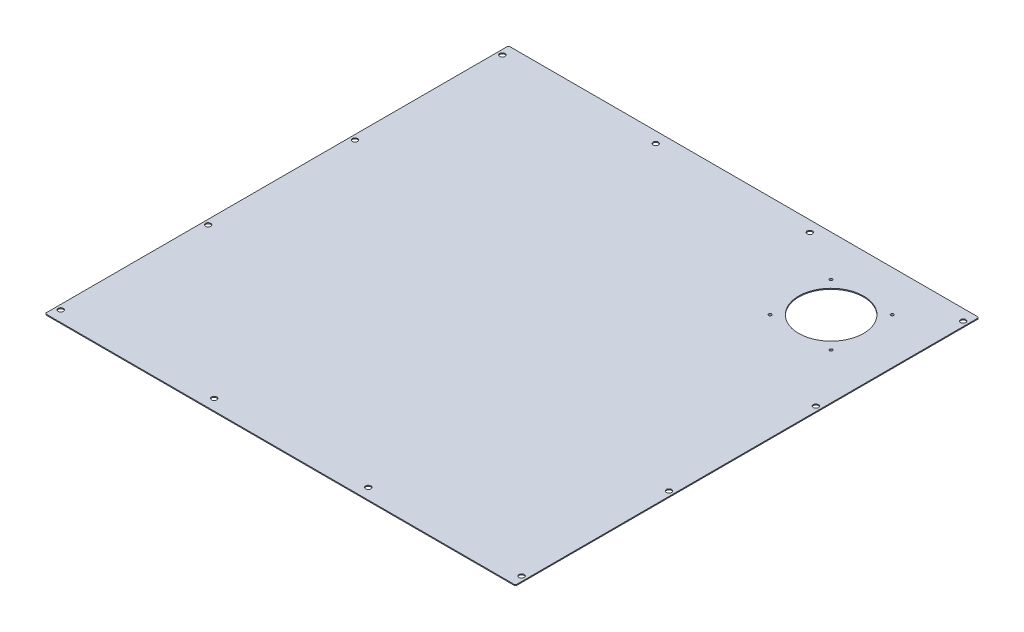
ISO-10303-21;
HEADER;
FILE_DESCRIPTION(('STEP AP214'),'2;1');
FILE_NAME('part.step','',(''),(''),'','','');
FILE_SCHEMA(('AUTOMOTIVE_DESIGN { 1 0 10303 214 1 1 1 1 }'));
ENDSEC;
DATA;
#1=APPLICATION_CONTEXT('core data for automotive mechanical design processes');
#2=APPLICATION_PROTOCOL_DEFINITION('international standard','automotive_design',2000,#1);
#3=PRODUCT_CONTEXT('',#1,'mechanical');
#4=PRODUCT('Part','Part','',(#3));
#5=PRODUCT_RELATED_PRODUCT_CATEGORY('part','',(#4));
#6=PRODUCT_DEFINITION_FORMATION('','',#4);
#7=PRODUCT_DEFINITION_CONTEXT('part definition',#1,'design');
#8=PRODUCT_DEFINITION('design','',#6,#7);
#9=PRODUCT_DEFINITION_SHAPE('','',#8);
#10=(LENGTH_UNIT() NAMED_UNIT(*) SI_UNIT(.MILLI.,.METRE.));
#11=(NAMED_UNIT(*) PLANE_ANGLE_UNIT() SI_UNIT($,.RADIAN.));
#12=(NAMED_UNIT(*) SI_UNIT($,.STERADIAN.) SOLID_ANGLE_UNIT());
#13=UNCERTAINTY_MEASURE_WITH_UNIT(LENGTH_MEASURE(1.E-05),#10,'distance_accuracy_value','');
#14=(GEOMETRIC_REPRESENTATION_CONTEXT(3) GLOBAL_UNCERTAINTY_ASSIGNED_CONTEXT((#13)) GLOBAL_UNIT_ASSIGNED_CONTEXT((#10,
#11,#12)) REPRESENTATION_CONTEXT('',''));
#15=CARTESIAN_POINT('',(0.,0.,0.));
#16=DIRECTION('',(0.,0.,1.));
#17=DIRECTION('',(1.,0.,0.));
#18=AXIS2_PLACEMENT_3D('',#15,#16,#17);
#19=CARTESIAN_POINT('',(198.65,-3.,-136.));
#20=DIRECTION('',(0.,1.,0.));
#21=DIRECTION('',(0.,0.,1.));
#22=AXIS2_PLACEMENT_3D('',#19,#20,#21);
#23=CYLINDRICAL_SURFACE('',#22,2.70000000000001);
#24=CARTESIAN_POINT('',(198.65,-3.,-136.));
#25=DIRECTION('',(0.,1.,0.));
#26=DIRECTION('',(0.,0.,1.));
#27=AXIS2_PLACEMENT_3D('',#24,#25,#26);
#28=CIRCLE('',#27,2.70000000000001);
#29=CARTESIAN_POINT('',(198.65,-3.,-133.3));
#30=VERTEX_POINT('',#29);
#31=EDGE_CURVE('E230',#30,#30,#28,.F.);
#32=ORIENTED_EDGE('',*,*,#31,.F.);
#33=EDGE_LOOP('',(#32));
#34=FACE_BOUND('',#33,.T.);
#35=CARTESIAN_POINT('',(198.65,-1.,-136.));
#36=DIRECTION('',(0.,1.,0.));
#37=DIRECTION('',(0.,0.,1.));
#38=AXIS2_PLACEMENT_3D('',#35,#36,#37);
#39=CIRCLE('',#38,2.70000000000001);
#40=CARTESIAN_POINT('',(198.65,-1.,-133.3));
#41=VERTEX_POINT('',#40);
#42=EDGE_CURVE('E222',#41,#41,#39,.F.);
#43=ORIENTED_EDGE('',*,*,#42,.T.);
#44=EDGE_LOOP('',(#43));
#45=FACE_BOUND('',#44,.T.);
#46=ADVANCED_FACE('F17',(#34,#45),#23,.T.);
#47=CARTESIAN_POINT('',(198.65,-3.,-200.));
#48=DIRECTION('',(0.,1.,0.));
#49=DIRECTION('',(0.,0.,1.));
#50=AXIS2_PLACEMENT_3D('',#47,#48,#49);
#51=CYLINDRICAL_SURFACE('',#50,2.70000000000001);
#52=CARTESIAN_POINT('',(198.65,-3.,-200.));
#53=DIRECTION('',(0.,1.,0.));
#54=DIRECTION('',(0.,0.,1.));
#55=AXIS2_PLACEMENT_3D('',#52,#53,#54);
#56=CIRCLE('',#55,2.70000000000001);
#57=CARTESIAN_POINT('',(198.65,-3.,-197.3));
#58=VERTEX_POINT('',#57);
#59=EDGE_CURVE('E228',#58,#58,#56,.F.);
#60=ORIENTED_EDGE('',*,*,#59,.F.);
#61=EDGE_LOOP('',(#60));
#62=FACE_BOUND('',#61,.T.);
#63=CARTESIAN_POINT('',(198.65,-1.,-200.));
#64=DIRECTION('',(0.,1.,0.));
#65=DIRECTION('',(0.,0.,1.));
#66=AXIS2_PLACEMENT_3D('',#63,#64,#65);
#67=CIRCLE('',#66,2.70000000000001);
#68=CARTESIAN_POINT('',(198.65,-1.,-197.3));
#69=VERTEX_POINT('',#68);
#70=EDGE_CURVE('E219',#69,#69,#67,.F.);
#71=ORIENTED_EDGE('',*,*,#70,.T.);
#72=EDGE_LOOP('',(#71));
#73=FACE_BOUND('',#72,.T.);
#74=ADVANCED_FACE('F244',(#62,#73),#51,.T.);
#75=CARTESIAN_POINT('',(134.65,-3.,-136.));
#76=DIRECTION('',(0.,1.,0.));
#77=DIRECTION('',(0.,0.,1.));
#78=AXIS2_PLACEMENT_3D('',#75,#76,#77);
#79=CYLINDRICAL_SURFACE('',#78,2.70000000000001);
#80=CARTESIAN_POINT('',(134.65,-3.,-136.));
#81=DIRECTION('',(0.,1.,0.));
#82=DIRECTION('',(0.,0.,1.));
#83=AXIS2_PLACEMENT_3D('',#80,#81,#82);
#84=CIRCLE('',#83,2.70000000000001);
#85=CARTESIAN_POINT('',(134.65,-3.,-133.3));
#86=VERTEX_POINT('',#85);
#87=EDGE_CURVE('E20',#86,#86,#84,.F.);
#88=ORIENTED_EDGE('',*,*,#87,.F.);
#89=EDGE_LOOP('',(#88));
#90=FACE_BOUND('',#89,.T.);
#91=CARTESIAN_POINT('',(134.65,-1.,-136.));
#92=DIRECTION('',(0.,1.,0.));
#93=DIRECTION('',(0.,0.,1.));
#94=AXIS2_PLACEMENT_3D('',#91,#92,#93);
#95=CIRCLE('',#94,2.70000000000001);
#96=CARTESIAN_POINT('',(134.65,-1.,-133.3));
#97=VERTEX_POINT('',#96);
#98=EDGE_CURVE('E216',#97,#97,#95,.F.);
#99=ORIENTED_EDGE('',*,*,#98,.T.);
#100=EDGE_LOOP('',(#99));
#101=FACE_BOUND('',#100,.T.);
#102=ADVANCED_FACE('F240',(#90,#101),#79,.T.);
#103=CARTESIAN_POINT('',(134.65,-3.,-200.));
#104=DIRECTION('',(0.,1.,0.));
#105=DIRECTION('',(0.,0.,1.));
#106=AXIS2_PLACEMENT_3D('',#103,#104,#105);
#107=CYLINDRICAL_SURFACE('',#106,2.70000000000001);
#108=CARTESIAN_POINT('',(134.65,-3.,-200.));
#109=DIRECTION('',(0.,1.,0.));
#110=DIRECTION('',(0.,0.,1.));
#111=AXIS2_PLACEMENT_3D('',#108,#109,#110);
#112=CIRCLE('',#111,2.70000000000001);
#113=CARTESIAN_POINT('',(134.65,-3.,-197.3));
#114=VERTEX_POINT('',#113);
#115=EDGE_CURVE('E225',#114,#114,#112,.F.);
#116=ORIENTED_EDGE('',*,*,#115,.F.);
#117=EDGE_LOOP('',(#116));
#118=FACE_BOUND('',#117,.T.);
#119=CARTESIAN_POINT('',(134.65,-1.,-200.));
#120=DIRECTION('',(0.,1.,0.));
#121=DIRECTION('',(0.,0.,1.));
#122=AXIS2_PLACEMENT_3D('',#119,#120,#121);
#123=CIRCLE('',#122,2.70000000000001);
#124=CARTESIAN_POINT('',(134.65,-1.,-197.3));
#125=VERTEX_POINT('',#124);
#126=EDGE_CURVE('E112',#125,#125,#123,.F.);
#127=ORIENTED_EDGE('',*,*,#126,.T.);
#128=EDGE_LOOP('',(#127));
#129=FACE_BOUND('',#128,.T.);
#130=ADVANCED_FACE('F243',(#118,#129),#107,.T.);
#131=CARTESIAN_POINT('',(134.65,-3.,-136.));
#132=DIRECTION('',(0.,-1.,0.));
#133=DIRECTION('',(0.,0.,-1.));
#134=AXIS2_PLACEMENT_3D('',#131,#132,#133);
#135=PLANE('',#134);
#136=ORIENTED_EDGE('',*,*,#87,.T.);
#137=EDGE_LOOP('',(#136));
#138=FACE_BOUND('',#137,.T.);
#139=CARTESIAN_POINT('',(134.65,-3.,-136.));
#140=DIRECTION('',(0.,-1.,0.));
#141=DIRECTION('',(0.,0.,-1.));
#142=AXIS2_PLACEMENT_3D('',#139,#140,#141);
#143=CIRCLE('',#142,1.5);
#144=CARTESIAN_POINT('',(134.65,-3.,-137.5));
#145=VERTEX_POINT('',#144);
#146=EDGE_CURVE('E111',#145,#145,#143,.F.);
#147=ORIENTED_EDGE('',*,*,#146,.T.);
#148=EDGE_LOOP('',(#147));
#149=FACE_BOUND('',#148,.T.);
#150=ADVANCED_FACE('F237',(#138,#149),#135,.T.);
#151=CARTESIAN_POINT('',(198.65,-3.,-136.));
#152=DIRECTION('',(0.,-1.,0.));
#153=DIRECTION('',(0.,0.,-1.));
#154=AXIS2_PLACEMENT_3D('',#151,#152,#153);
#155=PLANE('',#154);
#156=ORIENTED_EDGE('',*,*,#31,.T.);
#157=EDGE_LOOP('',(#156));
#158=FACE_BOUND('',#157,.T.);
#159=CARTESIAN_POINT('',(198.65,-3.,-136.));
#160=DIRECTION('',(0.,-1.,0.));
#161=DIRECTION('',(0.,0.,-1.));
#162=AXIS2_PLACEMENT_3D('',#159,#160,#161);
#163=CIRCLE('',#162,1.5);
#164=CARTESIAN_POINT('',(198.65,-3.,-137.5));
#165=VERTEX_POINT('',#164);
#166=EDGE_CURVE('E209',#165,#165,#163,.F.);
#167=ORIENTED_EDGE('',*,*,#166,.T.);
#168=EDGE_LOOP('',(#167));
#169=FACE_BOUND('',#168,.T.);
#170=ADVANCED_FACE('F372',(#158,#169),#155,.T.);
#171=CARTESIAN_POINT('',(198.65,-3.,-200.));
#172=DIRECTION('',(0.,-1.,0.));
#173=DIRECTION('',(0.,0.,-1.));
#174=AXIS2_PLACEMENT_3D('',#171,#172,#173);
#175=PLANE('',#174);
#176=ORIENTED_EDGE('',*,*,#59,.T.);
#177=EDGE_LOOP('',(#176));
#178=FACE_BOUND('',#177,.T.);
#179=CARTESIAN_POINT('',(198.65,-3.,-200.));
#180=DIRECTION('',(0.,-1.,0.));
#181=DIRECTION('',(0.,0.,-1.));
#182=AXIS2_PLACEMENT_3D('',#179,#180,#181);
#183=CIRCLE('',#182,1.5);
#184=CARTESIAN_POINT('',(198.65,-3.,-201.5));
#185=VERTEX_POINT('',#184);
#186=EDGE_CURVE('E206',#185,#185,#183,.F.);
#187=ORIENTED_EDGE('',*,*,#186,.T.);
#188=EDGE_LOOP('',(#187));
#189=FACE_BOUND('',#188,.T.);
#190=ADVANCED_FACE('F368',(#178,#189),#175,.T.);
#191=CARTESIAN_POINT('',(134.65,-3.,-200.));
#192=DIRECTION('',(0.,-1.,0.));
#193=DIRECTION('',(0.,0.,-1.));
#194=AXIS2_PLACEMENT_3D('',#191,#192,#193);
#195=PLANE('',#194);
#196=ORIENTED_EDGE('',*,*,#115,.T.);
#197=EDGE_LOOP('',(#196));
#198=FACE_BOUND('',#197,.T.);
#199=CARTESIAN_POINT('',(134.65,-3.,-200.));
#200=DIRECTION('',(0.,-1.,0.));
#201=DIRECTION('',(0.,0.,-1.));
#202=AXIS2_PLACEMENT_3D('',#199,#200,#201);
#203=CIRCLE('',#202,1.5);
#204=CARTESIAN_POINT('',(134.65,-3.,-201.5));
#205=VERTEX_POINT('',#204);
#206=EDGE_CURVE('E203',#205,#205,#203,.F.);
#207=ORIENTED_EDGE('',*,*,#206,.T.);
#208=EDGE_LOOP('',(#207));
#209=FACE_BOUND('',#208,.T.);
#210=ADVANCED_FACE('F251',(#198,#209),#195,.T.);
#211=CARTESIAN_POINT('',(0.,-1.,0.));
#212=DIRECTION('',(0.,1.,0.));
#213=DIRECTION('',(0.,0.,1.));
#214=AXIS2_PLACEMENT_3D('',#211,#212,#213);
#215=PLANE('',#214);
#216=DIRECTION('',(-0.707106781186567,0.,0.707106781186528));
#217=VECTOR('',#216,1.);
#218=CARTESIAN_POINT('',(245.65,-1.,243.));
#219=LINE('',#218,#217);
#220=CARTESIAN_POINT('',(246.65,-1.,242.));
#221=VERTEX_POINT('',#220);
#222=CARTESIAN_POINT('',(245.65,-1.,243.));
#223=VERTEX_POINT('',#222);
#224=EDGE_CURVE('E80',#221,#223,#219,.T.);
#225=ORIENTED_EDGE('',*,*,#224,.T.);
#226=DIRECTION('',(1.,0.,0.));
#227=VECTOR('',#226,1.);
#228=CARTESIAN_POINT('',(-246.65,-1.,243.));
#229=LINE('',#228,#227);
#230=CARTESIAN_POINT('',(-245.65,-1.,243.));
#231=VERTEX_POINT('',#230);
#232=EDGE_CURVE('E86',#231,#223,#229,.T.);
#233=ORIENTED_EDGE('',*,*,#232,.F.);
#234=DIRECTION('',(0.707106781186528,0.,0.707106781186567));
#235=VECTOR('',#234,1.);
#236=CARTESIAN_POINT('',(-246.65,-1.,242.));
#237=LINE('',#236,#235);
#238=CARTESIAN_POINT('',(-246.65,-1.,242.));
#239=VERTEX_POINT('',#238);
#240=EDGE_CURVE('E109',#239,#231,#237,.T.);
#241=ORIENTED_EDGE('',*,*,#240,.F.);
#242=DIRECTION('',(0.,0.,1.));
#243=VECTOR('',#242,1.);
#244=CARTESIAN_POINT('',(-246.65,-1.,-243.));
#245=LINE('',#244,#243);
#246=CARTESIAN_POINT('',(-246.65,-1.,-242.));
#247=VERTEX_POINT('',#246);
#248=EDGE_CURVE('E708',#247,#239,#245,.T.);
#249=ORIENTED_EDGE('',*,*,#248,.F.);
#250=DIRECTION('',(0.707106781186567,0.,-0.707106781186528));
#251=VECTOR('',#250,1.);
#252=CARTESIAN_POINT('',(-245.65,-1.,-243.));
#253=LINE('',#252,#251);
#254=CARTESIAN_POINT('',(-245.65,-1.,-243.));
#255=VERTEX_POINT('',#254);
#256=EDGE_CURVE('E706',#247,#255,#253,.T.);
#257=ORIENTED_EDGE('',*,*,#256,.T.);
#258=DIRECTION('',(-1.,0.,0.));
#259=VECTOR('',#258,1.);
#260=CARTESIAN_POINT('',(-246.65,-1.,-243.));
#261=LINE('',#260,#259);
#262=CARTESIAN_POINT('',(245.65,-1.,-243.));
#263=VERTEX_POINT('',#262);
#264=EDGE_CURVE('E693',#263,#255,#261,.T.);
#265=ORIENTED_EDGE('',*,*,#264,.F.);
#266=DIRECTION('',(0.707106781186528,0.,0.707106781186567));
#267=VECTOR('',#266,1.);
#268=CARTESIAN_POINT('',(246.65,-1.,-242.));
#269=LINE('',#268,#267);
#270=CARTESIAN_POINT('',(246.65,-1.,-242.));
#271=VERTEX_POINT('',#270);
#272=EDGE_CURVE('E691',#263,#271,#269,.T.);
#273=ORIENTED_EDGE('',*,*,#272,.T.);
#274=DIRECTION('',(0.,0.,-1.));
#275=VECTOR('',#274,1.);
#276=CARTESIAN_POINT('',(246.65,-1.,-243.));
#277=LINE('',#276,#275);
#278=EDGE_CURVE('E98',#221,#271,#277,.T.);
#279=ORIENTED_EDGE('',*,*,#278,.F.);
#280=EDGE_LOOP('',(#225,#233,#241,#249,#257,#265,#273,#279));
#281=FACE_BOUND('',#280,.T.);
#282=CARTESIAN_POINT('',(241.65,-0.999999999999999,-231.5));
#283=DIRECTION('',(0.,1.,0.));
#284=DIRECTION('',(0.,0.,1.));
#285=AXIS2_PLACEMENT_3D('',#282,#283,#284);
#286=CIRCLE('',#285,2.75);
#287=CARTESIAN_POINT('',(241.65,-0.999999999999999,-228.75));
#288=VERTEX_POINT('',#287);
#289=EDGE_CURVE('E93',#288,#288,#286,.T.);
#290=ORIENTED_EDGE('',*,*,#289,.T.);
#291=EDGE_LOOP('',(#290));
#292=FACE_BOUND('',#291,.T.);
#293=CARTESIAN_POINT('',(-80.75,-0.999999999999999,-231.5));
#294=DIRECTION('',(0.,1.,0.));
#295=DIRECTION('',(0.,0.,1.));
#296=AXIS2_PLACEMENT_3D('',#293,#294,#295);
#297=CIRCLE('',#296,2.75);
#298=CARTESIAN_POINT('',(-80.75,-0.999999999999999,-228.75));
#299=VERTEX_POINT('',#298);
#300=EDGE_CURVE('E167',#299,#299,#297,.T.);
#301=ORIENTED_EDGE('',*,*,#300,.T.);
#302=EDGE_LOOP('',(#301));
#303=FACE_BOUND('',#302,.T.);
#304=CARTESIAN_POINT('',(80.75,-0.999999999999999,-231.5));
#305=DIRECTION('',(0.,1.,0.));
#306=DIRECTION('',(0.,0.,1.));
#307=AXIS2_PLACEMENT_3D('',#304,#305,#306);
#308=CIRCLE('',#307,2.75);
#309=CARTESIAN_POINT('',(80.75,-0.999999999999999,-228.75));
#310=VERTEX_POINT('',#309);
#311=EDGE_CURVE('E170',#310,#310,#308,.T.);
#312=ORIENTED_EDGE('',*,*,#311,.T.);
#313=EDGE_LOOP('',(#312));
#314=FACE_BOUND('',#313,.T.);
#315=CARTESIAN_POINT('',(241.65,-0.999999999999999,231.5));
#316=DIRECTION('',(0.,1.,0.));
#317=DIRECTION('',(0.,0.,1.));
#318=AXIS2_PLACEMENT_3D('',#315,#316,#317);
#319=CIRCLE('',#318,2.75);
#320=CARTESIAN_POINT('',(241.65,-0.999999999999999,234.25));
#321=VERTEX_POINT('',#320);
#322=EDGE_CURVE('E173',#321,#321,#319,.T.);
#323=ORIENTED_EDGE('',*,*,#322,.T.);
#324=EDGE_LOOP('',(#323));
#325=FACE_BOUND('',#324,.T.);
#326=CARTESIAN_POINT('',(241.65,-0.999999999999999,77.));
#327=DIRECTION('',(0.,1.,0.));
#328=DIRECTION('',(0.,0.,1.));
#329=AXIS2_PLACEMENT_3D('',#326,#327,#328);
#330=CIRCLE('',#329,2.75);
#331=CARTESIAN_POINT('',(241.65,-0.999999999999999,79.75));
#332=VERTEX_POINT('',#331);
#333=EDGE_CURVE('E176',#332,#332,#330,.T.);
#334=ORIENTED_EDGE('',*,*,#333,.T.);
#335=EDGE_LOOP('',(#334));
#336=FACE_BOUND('',#335,.T.);
#337=CARTESIAN_POINT('',(241.65,-0.999999999999999,-77.));
#338=DIRECTION('',(0.,1.,0.));
#339=DIRECTION('',(0.,0.,1.));
#340=AXIS2_PLACEMENT_3D('',#337,#338,#339);
#341=CIRCLE('',#340,2.75);
#342=CARTESIAN_POINT('',(241.65,-0.999999999999999,-74.25));
#343=VERTEX_POINT('',#342);
#344=EDGE_CURVE('E179',#343,#343,#341,.T.);
#345=ORIENTED_EDGE('',*,*,#344,.T.);
#346=EDGE_LOOP('',(#345));
#347=FACE_BOUND('',#346,.T.);
#348=CARTESIAN_POINT('',(-241.65,-0.999999999999999,-77.));
#349=DIRECTION('',(0.,1.,0.));
#350=DIRECTION('',(0.,0.,1.));
#351=AXIS2_PLACEMENT_3D('',#348,#349,#350);
#352=CIRCLE('',#351,2.75);
#353=CARTESIAN_POINT('',(-241.65,-0.999999999999999,-74.25));
#354=VERTEX_POINT('',#353);
#355=EDGE_CURVE('E182',#354,#354,#352,.T.);
#356=ORIENTED_EDGE('',*,*,#355,.T.);
#357=EDGE_LOOP('',(#356));
#358=FACE_BOUND('',#357,.T.);
#359=CARTESIAN_POINT('',(-241.65,-0.999999999999999,77.));
#360=DIRECTION('',(0.,1.,0.));
#361=DIRECTION('',(0.,0.,1.));
#362=AXIS2_PLACEMENT_3D('',#359,#360,#361);
#363=CIRCLE('',#362,2.75);
#364=CARTESIAN_POINT('',(-241.65,-0.999999999999999,79.75));
#365=VERTEX_POINT('',#364);
#366=EDGE_CURVE('E185',#365,#365,#363,.T.);
#367=ORIENTED_EDGE('',*,*,#366,.T.);
#368=EDGE_LOOP('',(#367));
#369=FACE_BOUND('',#368,.T.);
#370=CARTESIAN_POINT('',(-241.65,-0.999999999999999,231.5));
#371=DIRECTION('',(0.,1.,0.));
#372=DIRECTION('',(0.,0.,1.));
#373=AXIS2_PLACEMENT_3D('',#370,#371,#372);
#374=CIRCLE('',#373,2.75);
#375=CARTESIAN_POINT('',(-241.65,-0.999999999999999,234.25));
#376=VERTEX_POINT('',#375);
#377=EDGE_CURVE('E188',#376,#376,#374,.T.);
#378=ORIENTED_EDGE('',*,*,#377,.T.);
#379=EDGE_LOOP('',(#378));
#380=FACE_BOUND('',#379,.T.);
#381=CARTESIAN_POINT('',(-80.75,-0.999999999999999,231.5));
#382=DIRECTION('',(0.,1.,0.));
#383=DIRECTION('',(0.,0.,1.));
#384=AXIS2_PLACEMENT_3D('',#381,#382,#383);
#385=CIRCLE('',#384,2.75);
#386=CARTESIAN_POINT('',(-80.75,-0.999999999999999,234.25));
#387=VERTEX_POINT('',#386);
#388=EDGE_CURVE('E191',#387,#387,#385,.T.);
#389=ORIENTED_EDGE('',*,*,#388,.T.);
#390=EDGE_LOOP('',(#389));
#391=FACE_BOUND('',#390,.T.);
#392=CARTESIAN_POINT('',(80.75,-0.999999999999999,231.5));
#393=DIRECTION('',(0.,1.,0.));
#394=DIRECTION('',(0.,0.,1.));
#395=AXIS2_PLACEMENT_3D('',#392,#393,#394);
#396=CIRCLE('',#395,2.75);
#397=CARTESIAN_POINT('',(80.75,-0.999999999999999,234.25));
#398=VERTEX_POINT('',#397);
#399=EDGE_CURVE('E194',#398,#398,#396,.T.);
#400=ORIENTED_EDGE('',*,*,#399,.T.);
#401=EDGE_LOOP('',(#400));
#402=FACE_BOUND('',#401,.T.);
#403=CARTESIAN_POINT('',(-241.65,-0.999999999999999,-231.5));
#404=DIRECTION('',(0.,1.,0.));
#405=DIRECTION('',(0.,0.,1.));
#406=AXIS2_PLACEMENT_3D('',#403,#404,#405);
#407=CIRCLE('',#406,2.75);
#408=CARTESIAN_POINT('',(-241.65,-0.999999999999999,-228.75));
#409=VERTEX_POINT('',#408);
#410=EDGE_CURVE('E197',#409,#409,#407,.T.);
#411=ORIENTED_EDGE('',*,*,#410,.T.);
#412=EDGE_LOOP('',(#411));
#413=FACE_BOUND('',#412,.T.);
#414=CARTESIAN_POINT('',(166.65,-1.,-168.));
#415=DIRECTION('',(0.,1.,0.));
#416=DIRECTION('',(0.,0.,1.));
#417=AXIS2_PLACEMENT_3D('',#414,#415,#416);
#418=CIRCLE('',#417,34.);
#419=CARTESIAN_POINT('',(166.65,-1.,-134.));
#420=VERTEX_POINT('',#419);
#421=EDGE_CURVE('E200',#420,#420,#418,.T.);
#422=ORIENTED_EDGE('',*,*,#421,.T.);
#423=EDGE_LOOP('',(#422));
#424=FACE_BOUND('',#423,.T.);
#425=ORIENTED_EDGE('',*,*,#126,.F.);
#426=EDGE_LOOP('',(#425));
#427=FACE_BOUND('',#426,.T.);
#428=ORIENTED_EDGE('',*,*,#98,.F.);
#429=EDGE_LOOP('',(#428));
#430=FACE_BOUND('',#429,.T.);
#431=ORIENTED_EDGE('',*,*,#70,.F.);
#432=EDGE_LOOP('',(#431));
#433=FACE_BOUND('',#432,.T.);
#434=ORIENTED_EDGE('',*,*,#42,.F.);
#435=EDGE_LOOP('',(#434));
#436=FACE_BOUND('',#435,.T.);
#437=ADVANCED_FACE('F95',(#281,#292,#303,#314,#325,#336,#347,#358,#369,#380,#391,#402,#413,#424,
#427,#430,#433,#436),#215,.F.);
#438=CARTESIAN_POINT('',(134.65,0.,-136.));
#439=DIRECTION('',(0.,-1.,0.));
#440=DIRECTION('',(0.,0.,-1.));
#441=AXIS2_PLACEMENT_3D('',#438,#439,#440);
#442=CYLINDRICAL_SURFACE('',#441,1.5);
#443=ORIENTED_EDGE('',*,*,#146,.F.);
#444=EDGE_LOOP('',(#443));
#445=FACE_BOUND('',#444,.T.);
#446=CARTESIAN_POINT('',(134.65,0.,-136.));
#447=DIRECTION('',(0.,-1.,0.));
#448=DIRECTION('',(0.,0.,-1.));
#449=AXIS2_PLACEMENT_3D('',#446,#447,#448);
#450=CIRCLE('',#449,1.5);
#451=CARTESIAN_POINT('',(134.65,0.,-137.5));
#452=VERTEX_POINT('',#451);
#453=EDGE_CURVE('E162',#452,#452,#450,.T.);
#454=ORIENTED_EDGE('',*,*,#453,.F.);
#455=EDGE_LOOP('',(#454));
#456=FACE_BOUND('',#455,.T.);
#457=ADVANCED_FACE('F250',(#445,#456),#442,.F.);
#458=CARTESIAN_POINT('',(198.65,0.,-136.));
#459=DIRECTION('',(0.,-1.,0.));
#460=DIRECTION('',(0.,0.,-1.));
#461=AXIS2_PLACEMENT_3D('',#458,#459,#460);
#462=CYLINDRICAL_SURFACE('',#461,1.5);
#463=ORIENTED_EDGE('',*,*,#166,.F.);
#464=EDGE_LOOP('',(#463));
#465=FACE_BOUND('',#464,.T.);
#466=CARTESIAN_POINT('',(198.65,0.,-136.));
#467=DIRECTION('',(0.,-1.,0.));
#468=DIRECTION('',(0.,0.,-1.));
#469=AXIS2_PLACEMENT_3D('',#466,#467,#468);
#470=CIRCLE('',#469,1.5);
#471=CARTESIAN_POINT('',(198.65,0.,-137.5));
#472=VERTEX_POINT('',#471);
#473=EDGE_CURVE('E159',#472,#472,#470,.T.);
#474=ORIENTED_EDGE('',*,*,#473,.F.);
#475=EDGE_LOOP('',(#474));
#476=FACE_BOUND('',#475,.T.);
#477=ADVANCED_FACE('F358',(#465,#476),#462,.F.);
#478=CARTESIAN_POINT('',(198.65,0.,-200.));
#479=DIRECTION('',(0.,-1.,0.));
#480=DIRECTION('',(0.,0.,-1.));
#481=AXIS2_PLACEMENT_3D('',#478,#479,#480);
#482=CYLINDRICAL_SURFACE('',#481,1.5);
#483=ORIENTED_EDGE('',*,*,#186,.F.);
#484=EDGE_LOOP('',(#483));
#485=FACE_BOUND('',#484,.T.);
#486=CARTESIAN_POINT('',(198.65,0.,-200.));
#487=DIRECTION('',(0.,-1.,0.));
#488=DIRECTION('',(0.,0.,-1.));
#489=AXIS2_PLACEMENT_3D('',#486,#487,#488);
#490=CIRCLE('',#489,1.5);
#491=CARTESIAN_POINT('',(198.65,0.,-201.5));
#492=VERTEX_POINT('',#491);
#493=EDGE_CURVE('E156',#492,#492,#490,.T.);
#494=ORIENTED_EDGE('',*,*,#493,.F.);
#495=EDGE_LOOP('',(#494));
#496=FACE_BOUND('',#495,.T.);
#497=ADVANCED_FACE('F354',(#485,#496),#482,.F.);
#498=CARTESIAN_POINT('',(134.65,0.,-200.));
#499=DIRECTION('',(0.,-1.,0.));
#500=DIRECTION('',(0.,0.,-1.));
#501=AXIS2_PLACEMENT_3D('',#498,#499,#500);
#502=CYLINDRICAL_SURFACE('',#501,1.5);
#503=ORIENTED_EDGE('',*,*,#206,.F.);
#504=EDGE_LOOP('',(#503));
#505=FACE_BOUND('',#504,.T.);
#506=CARTESIAN_POINT('',(134.65,0.,-200.));
#507=DIRECTION('',(0.,-1.,0.));
#508=DIRECTION('',(0.,0.,-1.));
#509=AXIS2_PLACEMENT_3D('',#506,#507,#508);
#510=CIRCLE('',#509,1.5);
#511=CARTESIAN_POINT('',(134.65,0.,-201.5));
#512=VERTEX_POINT('',#511);
#513=EDGE_CURVE('E153',#512,#512,#510,.T.);
#514=ORIENTED_EDGE('',*,*,#513,.F.);
#515=EDGE_LOOP('',(#514));
#516=FACE_BOUND('',#515,.T.);
#517=ADVANCED_FACE('F350',(#505,#516),#502,.F.);
#518=CARTESIAN_POINT('',(166.65,-1.,-168.));
#519=DIRECTION('',(0.,1.,0.));
#520=DIRECTION('',(0.,0.,1.));
#521=AXIS2_PLACEMENT_3D('',#518,#519,#520);
#522=CYLINDRICAL_SURFACE('',#521,34.);
#523=CARTESIAN_POINT('',(166.65,0.,-168.));
#524=DIRECTION('',(0.,1.,0.));
#525=DIRECTION('',(0.,0.,1.));
#526=AXIS2_PLACEMENT_3D('',#523,#524,#525);
#527=CIRCLE('',#526,34.);
#528=CARTESIAN_POINT('',(166.65,0.,-134.));
#529=VERTEX_POINT('',#528);
#530=EDGE_CURVE('E150',#529,#529,#527,.F.);
#531=ORIENTED_EDGE('',*,*,#530,.F.);
#532=EDGE_LOOP('',(#531));
#533=FACE_BOUND('',#532,.T.);
#534=ORIENTED_EDGE('',*,*,#421,.F.);
#535=EDGE_LOOP('',(#534));
#536=FACE_BOUND('',#535,.T.);
#537=ADVANCED_FACE('F346',(#533,#536),#522,.F.);
#538=CARTESIAN_POINT('',(-241.65,-10.,-231.5));
#539=DIRECTION('',(0.,1.,0.));
#540=DIRECTION('',(0.,0.,1.));
#541=AXIS2_PLACEMENT_3D('',#538,#539,#540);
#542=CYLINDRICAL_SURFACE('',#541,2.75);
#543=CARTESIAN_POINT('',(-241.65,0.,-231.5));
#544=DIRECTION('',(0.,1.,0.));
#545=DIRECTION('',(0.,0.,1.));
#546=AXIS2_PLACEMENT_3D('',#543,#544,#545);
#547=CIRCLE('',#546,2.75);
#548=CARTESIAN_POINT('',(-241.65,0.,-228.75));
#549=VERTEX_POINT('',#548);
#550=EDGE_CURVE('E147',#549,#549,#547,.F.);
#551=ORIENTED_EDGE('',*,*,#550,.F.);
#552=EDGE_LOOP('',(#551));
#553=FACE_BOUND('',#552,.T.);
#554=ORIENTED_EDGE('',*,*,#410,.F.);
#555=EDGE_LOOP('',(#554));
#556=FACE_BOUND('',#555,.T.);
#557=ADVANCED_FACE('F342',(#553,#556),#542,.F.);
#558=CARTESIAN_POINT('',(80.75,-10.,231.5));
#559=DIRECTION('',(0.,1.,0.));
#560=DIRECTION('',(0.,0.,1.));
#561=AXIS2_PLACEMENT_3D('',#558,#559,#560);
#562=CYLINDRICAL_SURFACE('',#561,2.75);
#563=CARTESIAN_POINT('',(80.75,0.,231.5));
#564=DIRECTION('',(0.,1.,0.));
#565=DIRECTION('',(0.,0.,1.));
#566=AXIS2_PLACEMENT_3D('',#563,#564,#565);
#567=CIRCLE('',#566,2.75);
#568=CARTESIAN_POINT('',(80.75,0.,234.25));
#569=VERTEX_POINT('',#568);
#570=EDGE_CURVE('E144',#569,#569,#567,.F.);
#571=ORIENTED_EDGE('',*,*,#570,.F.);
#572=EDGE_LOOP('',(#571));
#573=FACE_BOUND('',#572,.T.);
#574=ORIENTED_EDGE('',*,*,#399,.F.);
#575=EDGE_LOOP('',(#574));
#576=FACE_BOUND('',#575,.T.);
#577=ADVANCED_FACE('F338',(#573,#576),#562,.F.);
#578=CARTESIAN_POINT('',(-80.75,-10.,231.5));
#579=DIRECTION('',(0.,1.,0.));
#580=DIRECTION('',(0.,0.,1.));
#581=AXIS2_PLACEMENT_3D('',#578,#579,#580);
#582=CYLINDRICAL_SURFACE('',#581,2.75);
#583=CARTESIAN_POINT('',(-80.75,0.,231.5));
#584=DIRECTION('',(0.,1.,0.));
#585=DIRECTION('',(0.,0.,1.));
#586=AXIS2_PLACEMENT_3D('',#583,#584,#585);
#587=CIRCLE('',#586,2.75);
#588=CARTESIAN_POINT('',(-80.75,0.,234.25));
#589=VERTEX_POINT('',#588);
#590=EDGE_CURVE('E141',#589,#589,#587,.F.);
#591=ORIENTED_EDGE('',*,*,#590,.F.);
#592=EDGE_LOOP('',(#591));
#593=FACE_BOUND('',#592,.T.);
#594=ORIENTED_EDGE('',*,*,#388,.F.);
#595=EDGE_LOOP('',(#594));
#596=FACE_BOUND('',#595,.T.);
#597=ADVANCED_FACE('F334',(#593,#596),#582,.F.);
#598=CARTESIAN_POINT('',(-241.65,-10.,231.5));
#599=DIRECTION('',(0.,1.,0.));
#600=DIRECTION('',(0.,0.,1.));
#601=AXIS2_PLACEMENT_3D('',#598,#599,#600);
#602=CYLINDRICAL_SURFACE('',#601,2.75);
#603=CARTESIAN_POINT('',(-241.65,0.,231.5));
#604=DIRECTION('',(0.,1.,0.));
#605=DIRECTION('',(0.,0.,1.));
#606=AXIS2_PLACEMENT_3D('',#603,#604,#605);
#607=CIRCLE('',#606,2.75);
#608=CARTESIAN_POINT('',(-241.65,0.,234.25));
#609=VERTEX_POINT('',#608);
#610=EDGE_CURVE('E138',#609,#609,#607,.F.);
#611=ORIENTED_EDGE('',*,*,#610,.F.);
#612=EDGE_LOOP('',(#611));
#613=FACE_BOUND('',#612,.T.);
#614=ORIENTED_EDGE('',*,*,#377,.F.);
#615=EDGE_LOOP('',(#614));
#616=FACE_BOUND('',#615,.T.);
#617=ADVANCED_FACE('F330',(#613,#616),#602,.F.);
#618=CARTESIAN_POINT('',(-241.65,-10.,77.));
#619=DIRECTION('',(0.,1.,0.));
#620=DIRECTION('',(0.,0.,1.));
#621=AXIS2_PLACEMENT_3D('',#618,#619,#620);
#622=CYLINDRICAL_SURFACE('',#621,2.75);
#623=CARTESIAN_POINT('',(-241.65,0.,77.));
#624=DIRECTION('',(0.,1.,0.));
#625=DIRECTION('',(0.,0.,1.));
#626=AXIS2_PLACEMENT_3D('',#623,#624,#625);
#627=CIRCLE('',#626,2.75);
#628=CARTESIAN_POINT('',(-241.65,0.,79.75));
#629=VERTEX_POINT('',#628);
#630=EDGE_CURVE('E135',#629,#629,#627,.F.);
#631=ORIENTED_EDGE('',*,*,#630,.F.);
#632=EDGE_LOOP('',(#631));
#633=FACE_BOUND('',#632,.T.);
#634=ORIENTED_EDGE('',*,*,#366,.F.);
#635=EDGE_LOOP('',(#634));
#636=FACE_BOUND('',#635,.T.);
#637=ADVANCED_FACE('F326',(#633,#636),#622,.F.);
#638=CARTESIAN_POINT('',(-241.65,-10.,-77.));
#639=DIRECTION('',(0.,1.,0.));
#640=DIRECTION('',(0.,0.,1.));
#641=AXIS2_PLACEMENT_3D('',#638,#639,#640);
#642=CYLINDRICAL_SURFACE('',#641,2.75);
#643=CARTESIAN_POINT('',(-241.65,0.,-77.));
#644=DIRECTION('',(0.,1.,0.));
#645=DIRECTION('',(0.,0.,1.));
#646=AXIS2_PLACEMENT_3D('',#643,#644,#645);
#647=CIRCLE('',#646,2.75);
#648=CARTESIAN_POINT('',(-241.65,0.,-74.25));
#649=VERTEX_POINT('',#648);
#650=EDGE_CURVE('E132',#649,#649,#647,.F.);
#651=ORIENTED_EDGE('',*,*,#650,.F.);
#652=EDGE_LOOP('',(#651));
#653=FACE_BOUND('',#652,.T.);
#654=ORIENTED_EDGE('',*,*,#355,.F.);
#655=EDGE_LOOP('',(#654));
#656=FACE_BOUND('',#655,.T.);
#657=ADVANCED_FACE('F322',(#653,#656),#642,.F.);
#658=CARTESIAN_POINT('',(241.65,-10.,-77.));
#659=DIRECTION('',(0.,1.,0.));
#660=DIRECTION('',(0.,0.,1.));
#661=AXIS2_PLACEMENT_3D('',#658,#659,#660);
#662=CYLINDRICAL_SURFACE('',#661,2.75);
#663=CARTESIAN_POINT('',(241.65,0.,-77.));
#664=DIRECTION('',(0.,1.,0.));
#665=DIRECTION('',(0.,0.,1.));
#666=AXIS2_PLACEMENT_3D('',#663,#664,#665);
#667=CIRCLE('',#666,2.75);
#668=CARTESIAN_POINT('',(241.65,0.,-74.25));
#669=VERTEX_POINT('',#668);
#670=EDGE_CURVE('E129',#669,#669,#667,.F.);
#671=ORIENTED_EDGE('',*,*,#670,.F.);
#672=EDGE_LOOP('',(#671));
#673=FACE_BOUND('',#672,.T.);
#674=ORIENTED_EDGE('',*,*,#344,.F.);
#675=EDGE_LOOP('',(#674));
#676=FACE_BOUND('',#675,.T.);
#677=ADVANCED_FACE('F318',(#673,#676),#662,.F.);
#678=CARTESIAN_POINT('',(241.65,-10.,77.));
#679=DIRECTION('',(0.,1.,0.));
#680=DIRECTION('',(0.,0.,1.));
#681=AXIS2_PLACEMENT_3D('',#678,#679,#680);
#682=CYLINDRICAL_SURFACE('',#681,2.75);
#683=CARTESIAN_POINT('',(241.65,0.,77.));
#684=DIRECTION('',(0.,1.,0.));
#685=DIRECTION('',(0.,0.,1.));
#686=AXIS2_PLACEMENT_3D('',#683,#684,#685);
#687=CIRCLE('',#686,2.75);
#688=CARTESIAN_POINT('',(241.65,0.,79.75));
#689=VERTEX_POINT('',#688);
#690=EDGE_CURVE('E126',#689,#689,#687,.F.);
#691=ORIENTED_EDGE('',*,*,#690,.F.);
#692=EDGE_LOOP('',(#691));
#693=FACE_BOUND('',#692,.T.);
#694=ORIENTED_EDGE('',*,*,#333,.F.);
#695=EDGE_LOOP('',(#694));
#696=FACE_BOUND('',#695,.T.);
#697=ADVANCED_FACE('F314',(#693,#696),#682,.F.);
#698=CARTESIAN_POINT('',(241.65,-10.,231.5));
#699=DIRECTION('',(0.,1.,0.));
#700=DIRECTION('',(0.,0.,1.));
#701=AXIS2_PLACEMENT_3D('',#698,#699,#700);
#702=CYLINDRICAL_SURFACE('',#701,2.75);
#703=CARTESIAN_POINT('',(241.65,0.,231.5));
#704=DIRECTION('',(0.,1.,0.));
#705=DIRECTION('',(0.,0.,1.));
#706=AXIS2_PLACEMENT_3D('',#703,#704,#705);
#707=CIRCLE('',#706,2.75);
#708=CARTESIAN_POINT('',(241.65,0.,234.25));
#709=VERTEX_POINT('',#708);
#710=EDGE_CURVE('E123',#709,#709,#707,.F.);
#711=ORIENTED_EDGE('',*,*,#710,.F.);
#712=EDGE_LOOP('',(#711));
#713=FACE_BOUND('',#712,.T.);
#714=ORIENTED_EDGE('',*,*,#322,.F.);
#715=EDGE_LOOP('',(#714));
#716=FACE_BOUND('',#715,.T.);
#717=ADVANCED_FACE('F310',(#713,#716),#702,.F.);
#718=CARTESIAN_POINT('',(80.75,-10.,-231.5));
#719=DIRECTION('',(0.,1.,0.));
#720=DIRECTION('',(0.,0.,1.));
#721=AXIS2_PLACEMENT_3D('',#718,#719,#720);
#722=CYLINDRICAL_SURFACE('',#721,2.75);
#723=CARTESIAN_POINT('',(80.75,0.,-231.5));
#724=DIRECTION('',(0.,1.,0.));
#725=DIRECTION('',(0.,0.,1.));
#726=AXIS2_PLACEMENT_3D('',#723,#724,#725);
#727=CIRCLE('',#726,2.75);
#728=CARTESIAN_POINT('',(80.75,0.,-228.75));
#729=VERTEX_POINT('',#728);
#730=EDGE_CURVE('E120',#729,#729,#727,.F.);
#731=ORIENTED_EDGE('',*,*,#730,.F.);
#732=EDGE_LOOP('',(#731));
#733=FACE_BOUND('',#732,.T.);
#734=ORIENTED_EDGE('',*,*,#311,.F.);
#735=EDGE_LOOP('',(#734));
#736=FACE_BOUND('',#735,.T.);
#737=ADVANCED_FACE('F306',(#733,#736),#722,.F.);
#738=CARTESIAN_POINT('',(-80.75,-10.,-231.5));
#739=DIRECTION('',(0.,1.,0.));
#740=DIRECTION('',(0.,0.,1.));
#741=AXIS2_PLACEMENT_3D('',#738,#739,#740);
#742=CYLINDRICAL_SURFACE('',#741,2.75);
#743=CARTESIAN_POINT('',(-80.75,0.,-231.5));
#744=DIRECTION('',(0.,1.,0.));
#745=DIRECTION('',(0.,0.,1.));
#746=AXIS2_PLACEMENT_3D('',#743,#744,#745);
#747=CIRCLE('',#746,2.75);
#748=CARTESIAN_POINT('',(-80.75,0.,-228.75));
#749=VERTEX_POINT('',#748);
#750=EDGE_CURVE('E117',#749,#749,#747,.F.);
#751=ORIENTED_EDGE('',*,*,#750,.F.);
#752=EDGE_LOOP('',(#751));
#753=FACE_BOUND('',#752,.T.);
#754=ORIENTED_EDGE('',*,*,#300,.F.);
#755=EDGE_LOOP('',(#754));
#756=FACE_BOUND('',#755,.T.);
#757=ADVANCED_FACE('F302',(#753,#756),#742,.F.);
#758=CARTESIAN_POINT('',(241.65,-10.,-231.5));
#759=DIRECTION('',(0.,1.,0.));
#760=DIRECTION('',(0.,0.,1.));
#761=AXIS2_PLACEMENT_3D('',#758,#759,#760);
#762=CYLINDRICAL_SURFACE('',#761,2.75);
#763=CARTESIAN_POINT('',(241.65,0.,-231.5));
#764=DIRECTION('',(0.,1.,0.));
#765=DIRECTION('',(0.,0.,1.));
#766=AXIS2_PLACEMENT_3D('',#763,#764,#765);
#767=CIRCLE('',#766,2.75);
#768=CARTESIAN_POINT('',(241.65,0.,-228.75));
#769=VERTEX_POINT('',#768);
#770=EDGE_CURVE('E113',#769,#769,#767,.F.);
#771=ORIENTED_EDGE('',*,*,#770,.F.);
#772=EDGE_LOOP('',(#771));
#773=FACE_BOUND('',#772,.T.);
#774=ORIENTED_EDGE('',*,*,#289,.F.);
#775=EDGE_LOOP('',(#774));
#776=FACE_BOUND('',#775,.T.);
#777=ADVANCED_FACE('F299',(#773,#776),#762,.F.);
#778=CARTESIAN_POINT('',(-246.65,-1.,243.));
#779=DIRECTION('',(0.,0.,1.));
#780=DIRECTION('',(1.,0.,0.));
#781=AXIS2_PLACEMENT_3D('',#778,#779,#780);
#782=PLANE('',#781);
#783=DIRECTION('',(1.,0.,0.));
#784=VECTOR('',#783,1.);
#785=CARTESIAN_POINT('',(0.,0.,243.));
#786=LINE('',#785,#784);
#787=CARTESIAN_POINT('',(-245.65,0.,243.));
#788=VERTEX_POINT('',#787);
#789=CARTESIAN_POINT('',(245.65,0.,243.));
#790=VERTEX_POINT('',#789);
#791=EDGE_CURVE('E116',#788,#790,#786,.T.);
#792=ORIENTED_EDGE('',*,*,#791,.F.);
#793=DIRECTION('',(0.,1.,0.));
#794=VECTOR('',#793,1.);
#795=CARTESIAN_POINT('',(-245.65,-1.,243.));
#796=LINE('',#795,#794);
#797=EDGE_CURVE('E91',#788,#231,#796,.F.);
#798=ORIENTED_EDGE('',*,*,#797,.T.);
#799=ORIENTED_EDGE('',*,*,#232,.T.);
#800=DIRECTION('',(0.,1.,0.));
#801=VECTOR('',#800,1.);
#802=CARTESIAN_POINT('',(245.65,-1.,243.));
#803=LINE('',#802,#801);
#804=EDGE_CURVE('E88',#223,#790,#803,.T.);
#805=ORIENTED_EDGE('',*,*,#804,.T.);
#806=EDGE_LOOP('',(#792,#798,#799,#805));
#807=FACE_BOUND('',#806,.T.);
#808=ADVANCED_FACE('F87',(#807),#782,.T.);
#809=CARTESIAN_POINT('',(245.65,-1.,243.));
#810=DIRECTION('',(-0.707106781186528,0.,-0.707106781186567));
#811=DIRECTION('',(-0.707106781186567,0.,0.707106781186528));
#812=AXIS2_PLACEMENT_3D('',#809,#810,#811);
#813=PLANE('',#812);
#814=DIRECTION('',(0.,1.,0.));
#815=VECTOR('',#814,1.);
#816=CARTESIAN_POINT('',(246.65,-1.,242.));
#817=LINE('',#816,#815);
#818=CARTESIAN_POINT('',(246.65,0.,242.));
#819=VERTEX_POINT('',#818);
#820=EDGE_CURVE('E100',#819,#221,#817,.F.);
#821=ORIENTED_EDGE('',*,*,#820,.F.);
#822=DIRECTION('',(0.707106781186567,0.,-0.707106781186528));
#823=VECTOR('',#822,1.);
#824=CARTESIAN_POINT('',(245.65,0.,243.));
#825=LINE('',#824,#823);
#826=EDGE_CURVE('E104',#790,#819,#825,.T.);
#827=ORIENTED_EDGE('',*,*,#826,.F.);
#828=ORIENTED_EDGE('',*,*,#804,.F.);
#829=ORIENTED_EDGE('',*,*,#224,.F.);
#830=EDGE_LOOP('',(#821,#827,#828,#829));
#831=FACE_BOUND('',#830,.T.);
#832=ADVANCED_FACE('F102',(#831),#813,.F.);
#833=CARTESIAN_POINT('',(246.65,-1.,-243.));
#834=DIRECTION('',(1.,0.,0.));
#835=DIRECTION('',(0.,0.,-1.));
#836=AXIS2_PLACEMENT_3D('',#833,#834,#835);
#837=PLANE('',#836);
#838=ORIENTED_EDGE('',*,*,#278,.T.);
#839=DIRECTION('',(0.,1.,0.));
#840=VECTOR('',#839,1.);
#841=CARTESIAN_POINT('',(246.65,-1.,-242.));
#842=LINE('',#841,#840);
#843=CARTESIAN_POINT('',(246.65,0.,-242.));
#844=VERTEX_POINT('',#843);
#845=EDGE_CURVE('E687',#271,#844,#842,.T.);
#846=ORIENTED_EDGE('',*,*,#845,.T.);
#847=DIRECTION('',(0.,0.,1.));
#848=VECTOR('',#847,1.);
#849=CARTESIAN_POINT('',(246.65,0.,0.));
#850=LINE('',#849,#848);
#851=EDGE_CURVE('E717',#819,#844,#850,.F.);
#852=ORIENTED_EDGE('',*,*,#851,.F.);
#853=ORIENTED_EDGE('',*,*,#820,.T.);
#854=EDGE_LOOP('',(#838,#846,#852,#853));
#855=FACE_BOUND('',#854,.T.);
#856=ADVANCED_FACE('F290',(#855),#837,.T.);
#857=CARTESIAN_POINT('',(246.65,-1.,-242.));
#858=DIRECTION('',(-0.707106781186567,0.,0.707106781186528));
#859=DIRECTION('',(0.707106781186528,0.,0.707106781186567));
#860=AXIS2_PLACEMENT_3D('',#857,#858,#859);
#861=PLANE('',#860);
#862=DIRECTION('',(0.,1.,0.));
#863=VECTOR('',#862,1.);
#864=CARTESIAN_POINT('',(245.65,-1.,-243.));
#865=LINE('',#864,#863);
#866=CARTESIAN_POINT('',(245.65,0.,-243.));
#867=VERTEX_POINT('',#866);
#868=EDGE_CURVE('E702',#867,#263,#865,.F.);
#869=ORIENTED_EDGE('',*,*,#868,.F.);
#870=DIRECTION('',(-0.707106781186528,0.,-0.707106781186567));
#871=VECTOR('',#870,1.);
#872=CARTESIAN_POINT('',(246.65,0.,-242.));
#873=LINE('',#872,#871);
#874=EDGE_CURVE('E697',#844,#867,#873,.T.);
#875=ORIENTED_EDGE('',*,*,#874,.F.);
#876=ORIENTED_EDGE('',*,*,#845,.F.);
#877=ORIENTED_EDGE('',*,*,#272,.F.);
#878=EDGE_LOOP('',(#869,#875,#876,#877));
#879=FACE_BOUND('',#878,.T.);
#880=ADVANCED_FACE('F286',(#879),#861,.F.);
#881=CARTESIAN_POINT('',(-246.65,-1.,-243.));
#882=DIRECTION('',(0.,0.,-1.));
#883=DIRECTION('',(-1.,0.,0.));
#884=AXIS2_PLACEMENT_3D('',#881,#882,#883);
#885=PLANE('',#884);
#886=DIRECTION('',(1.,0.,0.));
#887=VECTOR('',#886,1.);
#888=CARTESIAN_POINT('',(0.,0.,-243.));
#889=LINE('',#888,#887);
#890=CARTESIAN_POINT('',(-245.65,0.,-243.));
#891=VERTEX_POINT('',#890);
#892=EDGE_CURVE('E720',#867,#891,#889,.F.);
#893=ORIENTED_EDGE('',*,*,#892,.F.);
#894=ORIENTED_EDGE('',*,*,#868,.T.);
#895=ORIENTED_EDGE('',*,*,#264,.T.);
#896=DIRECTION('',(0.,1.,0.));
#897=VECTOR('',#896,1.);
#898=CARTESIAN_POINT('',(-245.65,-1.,-243.));
#899=LINE('',#898,#897);
#900=EDGE_CURVE('E704',#255,#891,#899,.T.);
#901=ORIENTED_EDGE('',*,*,#900,.T.);
#902=EDGE_LOOP('',(#893,#894,#895,#901));
#903=FACE_BOUND('',#902,.T.);
#904=ADVANCED_FACE('F282',(#903),#885,.T.);
#905=CARTESIAN_POINT('',(-245.65,-1.,-243.));
#906=DIRECTION('',(0.707106781186528,0.,0.707106781186567));
#907=DIRECTION('',(0.707106781186567,0.,-0.707106781186528));
#908=AXIS2_PLACEMENT_3D('',#905,#906,#907);
#909=PLANE('',#908);
#910=DIRECTION('',(0.,1.,0.));
#911=VECTOR('',#910,1.);
#912=CARTESIAN_POINT('',(-246.65,-1.,-242.));
#913=LINE('',#912,#911);
#914=CARTESIAN_POINT('',(-246.65,0.,-242.));
#915=VERTEX_POINT('',#914);
#916=EDGE_CURVE('E710',#915,#247,#913,.F.);
#917=ORIENTED_EDGE('',*,*,#916,.F.);
#918=DIRECTION('',(-0.707106781186567,0.,0.707106781186528));
#919=VECTOR('',#918,1.);
#920=CARTESIAN_POINT('',(-245.65,0.,-243.));
#921=LINE('',#920,#919);
#922=EDGE_CURVE('E723',#891,#915,#921,.T.);
#923=ORIENTED_EDGE('',*,*,#922,.F.);
#924=ORIENTED_EDGE('',*,*,#900,.F.);
#925=ORIENTED_EDGE('',*,*,#256,.F.);
#926=EDGE_LOOP('',(#917,#923,#924,#925));
#927=FACE_BOUND('',#926,.T.);
#928=ADVANCED_FACE('F279',(#927),#909,.F.);
#929=CARTESIAN_POINT('',(-246.65,-1.,-243.));
#930=DIRECTION('',(-1.,0.,0.));
#931=DIRECTION('',(0.,0.,1.));
#932=AXIS2_PLACEMENT_3D('',#929,#930,#931);
#933=PLANE('',#932);
#934=DIRECTION('',(0.,0.,1.));
#935=VECTOR('',#934,1.);
#936=CARTESIAN_POINT('',(-246.65,0.,0.));
#937=LINE('',#936,#935);
#938=CARTESIAN_POINT('',(-246.65,0.,242.));
#939=VERTEX_POINT('',#938);
#940=EDGE_CURVE('E26',#915,#939,#937,.T.);
#941=ORIENTED_EDGE('',*,*,#940,.F.);
#942=ORIENTED_EDGE('',*,*,#916,.T.);
#943=ORIENTED_EDGE('',*,*,#248,.T.);
#944=DIRECTION('',(0.,1.,0.));
#945=VECTOR('',#944,1.);
#946=CARTESIAN_POINT('',(-246.65,-1.,242.));
#947=LINE('',#946,#945);
#948=EDGE_CURVE('E35',#239,#939,#947,.T.);
#949=ORIENTED_EDGE('',*,*,#948,.T.);
#950=EDGE_LOOP('',(#941,#942,#943,#949));
#951=FACE_BOUND('',#950,.T.);
#952=ADVANCED_FACE('F271',(#951),#933,.T.);
#953=CARTESIAN_POINT('',(-246.65,-1.,242.));
#954=DIRECTION('',(0.707106781186567,0.,-0.707106781186528));
#955=DIRECTION('',(-0.707106781186528,0.,-0.707106781186567));
#956=AXIS2_PLACEMENT_3D('',#953,#954,#955);
#957=PLANE('',#956);
#958=ORIENTED_EDGE('',*,*,#797,.F.);
#959=DIRECTION('',(0.707106781186528,0.,0.707106781186567));
#960=VECTOR('',#959,1.);
#961=CARTESIAN_POINT('',(-246.65,0.,242.));
#962=LINE('',#961,#960);
#963=EDGE_CURVE('E10',#939,#788,#962,.T.);
#964=ORIENTED_EDGE('',*,*,#963,.F.);
#965=ORIENTED_EDGE('',*,*,#948,.F.);
#966=ORIENTED_EDGE('',*,*,#240,.T.);
#967=EDGE_LOOP('',(#958,#964,#965,#966));
#968=FACE_BOUND('',#967,.T.);
#969=ADVANCED_FACE('F265',(#968),#957,.F.);
#970=CARTESIAN_POINT('',(0.,0.,0.));
#971=DIRECTION('',(0.,1.,0.));
#972=DIRECTION('',(0.,0.,1.));
#973=AXIS2_PLACEMENT_3D('',#970,#971,#972);
#974=PLANE('',#973);
#975=ORIENTED_EDGE('',*,*,#940,.T.);
#976=ORIENTED_EDGE('',*,*,#963,.T.);
#977=ORIENTED_EDGE('',*,*,#791,.T.);
#978=ORIENTED_EDGE('',*,*,#826,.T.);
#979=ORIENTED_EDGE('',*,*,#851,.T.);
#980=ORIENTED_EDGE('',*,*,#874,.T.);
#981=ORIENTED_EDGE('',*,*,#892,.T.);
#982=ORIENTED_EDGE('',*,*,#922,.T.);
#983=EDGE_LOOP('',(#975,#976,#977,#978,#979,#980,#981,#982));
#984=FACE_BOUND('',#983,.T.);
#985=ORIENTED_EDGE('',*,*,#770,.T.);
#986=EDGE_LOOP('',(#985));
#987=FACE_BOUND('',#986,.T.);
#988=ORIENTED_EDGE('',*,*,#750,.T.);
#989=EDGE_LOOP('',(#988));
#990=FACE_BOUND('',#989,.T.);
#991=ORIENTED_EDGE('',*,*,#730,.T.);
#992=EDGE_LOOP('',(#991));
#993=FACE_BOUND('',#992,.T.);
#994=ORIENTED_EDGE('',*,*,#710,.T.);
#995=EDGE_LOOP('',(#994));
#996=FACE_BOUND('',#995,.T.);
#997=ORIENTED_EDGE('',*,*,#690,.T.);
#998=EDGE_LOOP('',(#997));
#999=FACE_BOUND('',#998,.T.);
#1000=ORIENTED_EDGE('',*,*,#670,.T.);
#1001=EDGE_LOOP('',(#1000));
#1002=FACE_BOUND('',#1001,.T.);
#1003=ORIENTED_EDGE('',*,*,#650,.T.);
#1004=EDGE_LOOP('',(#1003));
#1005=FACE_BOUND('',#1004,.T.);
#1006=ORIENTED_EDGE('',*,*,#630,.T.);
#1007=EDGE_LOOP('',(#1006));
#1008=FACE_BOUND('',#1007,.T.);
#1009=ORIENTED_EDGE('',*,*,#610,.T.);
#1010=EDGE_LOOP('',(#1009));
#1011=FACE_BOUND('',#1010,.T.);
#1012=ORIENTED_EDGE('',*,*,#590,.T.);
#1013=EDGE_LOOP('',(#1012));
#1014=FACE_BOUND('',#1013,.T.);
#1015=ORIENTED_EDGE('',*,*,#570,.T.);
#1016=EDGE_LOOP('',(#1015));
#1017=FACE_BOUND('',#1016,.T.);
#1018=ORIENTED_EDGE('',*,*,#550,.T.);
#1019=EDGE_LOOP('',(#1018));
#1020=FACE_BOUND('',#1019,.T.);
#1021=ORIENTED_EDGE('',*,*,#530,.T.);
#1022=EDGE_LOOP('',(#1021));
#1023=FACE_BOUND('',#1022,.T.);
#1024=ORIENTED_EDGE('',*,*,#513,.T.);
#1025=EDGE_LOOP('',(#1024));
#1026=FACE_BOUND('',#1025,.T.);
#1027=ORIENTED_EDGE('',*,*,#493,.T.);
#1028=EDGE_LOOP('',(#1027));
#1029=FACE_BOUND('',#1028,.T.);
#1030=ORIENTED_EDGE('',*,*,#473,.T.);
#1031=EDGE_LOOP('',(#1030));
#1032=FACE_BOUND('',#1031,.T.);
#1033=ORIENTED_EDGE('',*,*,#453,.T.);
#1034=EDGE_LOOP('',(#1033));
#1035=FACE_BOUND('',#1034,.T.);
#1036=ADVANCED_FACE('F263',(#984,#987,#990,#993,#996,#999,#1002,#1005,#1008,#1011,#1014,#1017,
#1020,#1023,#1026,#1029,#1032,#1035),#974,.T.);
#1037=CLOSED_SHELL('',(#46,#74,#102,#130,#150,#170,#190,#210,#437,#457,#477,#497,#517,#537,#557,
#577,#597,#617,#637,#657,#677,#697,#717,#737,#757,#777,#808,#832,#856,#880,#904,#928,#952,#969,#1036));
#1038=MANIFOLD_SOLID_BREP('B1',#1037);
#1039=ADVANCED_BREP_SHAPE_REPRESENTATION('',(#18,#1038),#14);
#1040=SHAPE_DEFINITION_REPRESENTATION(#9,#1039);
ENDSEC;
END-ISO-10303-21;
